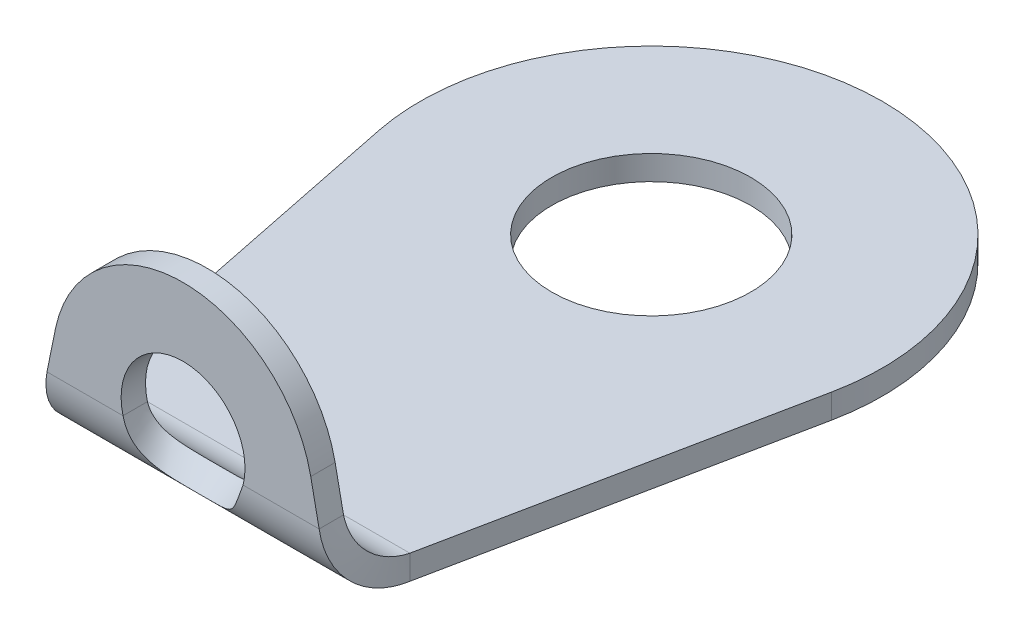
ISO-10303-21;
HEADER;
FILE_DESCRIPTION(('STEP AP214'),'2;1');
FILE_NAME('part.step','',(''),(''),'','','');
FILE_SCHEMA(('AUTOMOTIVE_DESIGN { 1 0 10303 214 1 1 1 1 }'));
ENDSEC;
DATA;
#1=APPLICATION_CONTEXT('core data for automotive mechanical design processes');
#2=APPLICATION_PROTOCOL_DEFINITION('international standard','automotive_design',2000,#1);
#3=PRODUCT_CONTEXT('',#1,'mechanical');
#4=PRODUCT('Part','Part','',(#3));
#5=PRODUCT_RELATED_PRODUCT_CATEGORY('part','',(#4));
#6=PRODUCT_DEFINITION_FORMATION('','',#4);
#7=PRODUCT_DEFINITION_CONTEXT('part definition',#1,'design');
#8=PRODUCT_DEFINITION('design','',#6,#7);
#9=PRODUCT_DEFINITION_SHAPE('','',#8);
#10=(LENGTH_UNIT() NAMED_UNIT(*) SI_UNIT(.MILLI.,.METRE.));
#11=(NAMED_UNIT(*) PLANE_ANGLE_UNIT() SI_UNIT($,.RADIAN.));
#12=(NAMED_UNIT(*) SI_UNIT($,.STERADIAN.) SOLID_ANGLE_UNIT());
#13=UNCERTAINTY_MEASURE_WITH_UNIT(LENGTH_MEASURE(1.E-05),#10,'distance_accuracy_value','');
#14=(GEOMETRIC_REPRESENTATION_CONTEXT(3) GLOBAL_UNCERTAINTY_ASSIGNED_CONTEXT((#13)) GLOBAL_UNIT_ASSIGNED_CONTEXT((#10,
#11,#12)) REPRESENTATION_CONTEXT('',''));
#15=CARTESIAN_POINT('',(0.,0.,0.));
#16=DIRECTION('',(0.,0.,1.));
#17=DIRECTION('',(1.,0.,0.));
#18=AXIS2_PLACEMENT_3D('',#15,#16,#17);
#19=CARTESIAN_POINT('',(3.52763822802631,-6.17797967136799,7.29385006179595));
#20=DIRECTION('',(0.979899507785085,0.199491740787802,0.));
#21=DIRECTION('',(0.199491740787802,-0.979899507785085,0.));
#22=AXIS2_PLACEMENT_3D('',#19,#20,#21);
#23=PLANE('',#22);
#24=DIRECTION('',(0.199491740787802,-0.979899507785085,0.));
#25=VECTOR('',#24,1.);
#26=CARTESIAN_POINT('',(3.52763822802631,-6.17797967136799,7.29385006179595));
#27=LINE('',#26,#25);
#28=CARTESIAN_POINT('',(1.98919600080372,1.37881829559516,7.29385006179592));
#29=VERTEX_POINT('',#28);
#30=CARTESIAN_POINT('',(2.11994129125054,0.736600000000004,7.29385006179592));
#31=VERTEX_POINT('',#30);
#32=EDGE_CURVE('E244',#29,#31,#27,.T.);
#33=ORIENTED_EDGE('',*,*,#32,.T.);
#34=CARTESIAN_POINT('',(2.11994129125054,0.7366,6.91385006179592));
#35=CARTESIAN_POINT('',(2.11994129125054,0.7366,7.29385006179592));
#36=B_SPLINE_CURVE_WITH_KNOTS('',1,(#34,#35),.UNSPECIFIED.,.F.,.F.,(2,2),(0.,1.),.UNSPECIFIED.);
#37=CARTESIAN_POINT('',(2.11994129125054,0.7366,6.91385006179592));
#38=VERTEX_POINT('',#37);
#39=EDGE_CURVE('E12',#31,#38,#36,.F.);
#40=ORIENTED_EDGE('',*,*,#39,.T.);
#41=DIRECTION('',(0.199491740787802,-0.979899507785085,0.));
#42=VECTOR('',#41,1.);
#43=CARTESIAN_POINT('',(3.52763822802631,-6.17797967136799,6.91385006179595));
#44=LINE('',#43,#42);
#45=CARTESIAN_POINT('',(1.98919600080372,1.37881829559516,6.91385006179592));
#46=VERTEX_POINT('',#45);
#47=EDGE_CURVE('E180',#46,#38,#44,.T.);
#48=ORIENTED_EDGE('',*,*,#47,.F.);
#49=DIRECTION('',(0.,0.,-1.));
#50=VECTOR('',#49,1.);
#51=CARTESIAN_POINT('',(1.98919600080372,1.37881829559516,7.29385006179592));
#52=LINE('',#51,#50);
#53=EDGE_CURVE('E154',#29,#46,#52,.T.);
#54=ORIENTED_EDGE('',*,*,#53,.F.);
#55=EDGE_LOOP('',(#33,#40,#48,#54));
#56=FACE_BOUND('',#55,.T.);
#57=ADVANCED_FACE('F64',(#56),#23,.T.);
#58=CARTESIAN_POINT('',(-3.52763822802631,-6.17797967136799,7.29385006179595));
#59=DIRECTION('',(-0.979899507785085,0.199491740787802,0.));
#60=DIRECTION('',(0.199491740787802,0.979899507785085,0.));
#61=AXIS2_PLACEMENT_3D('',#58,#59,#60);
#62=PLANE('',#61);
#63=DIRECTION('',(0.199491740787802,0.979899507785085,0.));
#64=VECTOR('',#63,1.);
#65=CARTESIAN_POINT('',(-3.52763822802631,-6.17797967136799,6.91385006179595));
#66=LINE('',#65,#64);
#67=CARTESIAN_POINT('',(-2.11994129125054,0.736600000000004,6.91385006179592));
#68=VERTEX_POINT('',#67);
#69=CARTESIAN_POINT('',(-1.98919600080372,1.37881829559516,6.91385006179592));
#70=VERTEX_POINT('',#69);
#71=EDGE_CURVE('E185',#68,#70,#66,.T.);
#72=ORIENTED_EDGE('',*,*,#71,.F.);
#73=CARTESIAN_POINT('',(-2.11994129125054,0.7366,7.29385006179592));
#74=CARTESIAN_POINT('',(-2.11994129125054,0.7366,6.91385006179592));
#75=B_SPLINE_CURVE_WITH_KNOTS('',1,(#73,#74),.UNSPECIFIED.,.F.,.F.,(2,2),(0.,1.),.UNSPECIFIED.);
#76=CARTESIAN_POINT('',(-2.11994129125054,0.736600000000006,7.29385006179592));
#77=VERTEX_POINT('',#76);
#78=EDGE_CURVE('E153',#68,#77,#75,.F.);
#79=ORIENTED_EDGE('',*,*,#78,.T.);
#80=DIRECTION('',(0.199491740787802,0.979899507785085,0.));
#81=VECTOR('',#80,1.);
#82=CARTESIAN_POINT('',(-3.52763822802631,-6.17797967136799,7.29385006179595));
#83=LINE('',#82,#81);
#84=CARTESIAN_POINT('',(-1.98919600080372,1.37881829559517,7.29385006179592));
#85=VERTEX_POINT('',#84);
#86=EDGE_CURVE('E172',#77,#85,#83,.T.);
#87=ORIENTED_EDGE('',*,*,#86,.T.);
#88=DIRECTION('',(0.,0.,-1.));
#89=VECTOR('',#88,1.);
#90=CARTESIAN_POINT('',(-1.98919600080372,1.37881829559517,7.29385006179592));
#91=LINE('',#90,#89);
#92=EDGE_CURVE('E263',#85,#70,#91,.T.);
#93=ORIENTED_EDGE('',*,*,#92,.T.);
#94=EDGE_LOOP('',(#72,#79,#87,#93));
#95=FACE_BOUND('',#94,.T.);
#96=ADVANCED_FACE('F184',(#95),#62,.T.);
#97=CARTESIAN_POINT('',(0.,-6.89614993820407,7.29385006179595));
#98=DIRECTION('',(0.,0.,1.));
#99=DIRECTION('',(0.,-1.,0.));
#100=AXIS2_PLACEMENT_3D('',#97,#98,#99);
#101=PLANE('',#100);
#102=ORIENTED_EDGE('',*,*,#86,.F.);
#103=DIRECTION('',(1.,0.,0.));
#104=VECTOR('',#103,1.);
#105=CARTESIAN_POINT('',(0.,0.736600000000003,7.29385006179592));
#106=LINE('',#105,#104);
#107=CARTESIAN_POINT('',(-0.935380889358891,0.736600000000002,7.29385006179592));
#108=VERTEX_POINT('',#107);
#109=EDGE_CURVE('E144',#77,#108,#106,.T.);
#110=ORIENTED_EDGE('',*,*,#109,.T.);
#111=CARTESIAN_POINT('',(0.,0.973850061795926,7.29385006179592));
#112=DIRECTION('',(0.,0.,-1.));
#113=DIRECTION('',(0.,1.,0.));
#114=AXIS2_PLACEMENT_3D('',#111,#112,#113);
#115=CIRCLE('',#114,0.965);
#116=CARTESIAN_POINT('',(0.935380889358893,0.736600000000003,7.29385006179592));
#117=VERTEX_POINT('',#116);
#118=EDGE_CURVE('E258',#108,#117,#115,.T.);
#119=ORIENTED_EDGE('',*,*,#118,.T.);
#120=DIRECTION('',(1.,0.,0.));
#121=VECTOR('',#120,1.);
#122=CARTESIAN_POINT('',(0.,0.736600000000003,7.29385006179592));
#123=LINE('',#122,#121);
#124=EDGE_CURVE('E257',#117,#31,#123,.T.);
#125=ORIENTED_EDGE('',*,*,#124,.T.);
#126=ORIENTED_EDGE('',*,*,#32,.F.);
#127=CARTESIAN_POINT('',(0.,0.973850061795924,7.29385006179592));
#128=DIRECTION('',(0.,0.,-1.));
#129=DIRECTION('',(0.,-1.,0.));
#130=AXIS2_PLACEMENT_3D('',#127,#128,#129);
#131=CIRCLE('',#130,2.03);
#132=EDGE_CURVE('E176',#85,#29,#131,.T.);
#133=ORIENTED_EDGE('',*,*,#132,.F.);
#134=EDGE_LOOP('',(#102,#110,#119,#125,#126,#133));
#135=FACE_BOUND('',#134,.T.);
#136=ADVANCED_FACE('F173',(#135),#101,.T.);
#137=CARTESIAN_POINT('',(0.,0.973850061795924,7.29385006179592));
#138=DIRECTION('',(0.,0.,-1.));
#139=DIRECTION('',(0.,1.,0.));
#140=AXIS2_PLACEMENT_3D('',#137,#138,#139);
#141=CYLINDRICAL_SURFACE('',#140,2.03);
#142=CARTESIAN_POINT('',(0.,0.973850061795923,6.91385006179592));
#143=DIRECTION('',(0.,0.,-1.));
#144=DIRECTION('',(0.,-1.,0.));
#145=AXIS2_PLACEMENT_3D('',#142,#143,#144);
#146=CIRCLE('',#145,2.03);
#147=EDGE_CURVE('E239',#70,#46,#146,.T.);
#148=ORIENTED_EDGE('',*,*,#147,.F.);
#149=ORIENTED_EDGE('',*,*,#92,.F.);
#150=ORIENTED_EDGE('',*,*,#132,.T.);
#151=ORIENTED_EDGE('',*,*,#53,.T.);
#152=EDGE_LOOP('',(#148,#149,#150,#151));
#153=FACE_BOUND('',#152,.T.);
#154=ADVANCED_FACE('F209',(#153),#141,.T.);
#155=CARTESIAN_POINT('',(0.,-6.89614993820407,6.91385006179595));
#156=DIRECTION('',(0.,0.,1.));
#157=DIRECTION('',(0.,-1.,0.));
#158=AXIS2_PLACEMENT_3D('',#155,#156,#157);
#159=PLANE('',#158);
#160=DIRECTION('',(1.,0.,0.));
#161=VECTOR('',#160,1.);
#162=CARTESIAN_POINT('',(0.,0.736600000000001,6.91385006179592));
#163=LINE('',#162,#161);
#164=CARTESIAN_POINT('',(-0.935380889358891,0.736600000000002,6.91385006179592));
#165=VERTEX_POINT('',#164);
#166=EDGE_CURVE('E187',#68,#165,#163,.T.);
#167=ORIENTED_EDGE('',*,*,#166,.F.);
#168=ORIENTED_EDGE('',*,*,#71,.T.);
#169=ORIENTED_EDGE('',*,*,#147,.T.);
#170=ORIENTED_EDGE('',*,*,#47,.T.);
#171=DIRECTION('',(1.,0.,0.));
#172=VECTOR('',#171,1.);
#173=CARTESIAN_POINT('',(0.,0.736600000000001,6.91385006179592));
#174=LINE('',#173,#172);
#175=CARTESIAN_POINT('',(0.935380889358893,0.736600000000002,6.91385006179592));
#176=VERTEX_POINT('',#175);
#177=EDGE_CURVE('E74',#176,#38,#174,.T.);
#178=ORIENTED_EDGE('',*,*,#177,.F.);
#179=CARTESIAN_POINT('',(0.,0.973850061795924,6.91385006179592));
#180=DIRECTION('',(0.,0.,-1.));
#181=DIRECTION('',(0.,1.,0.));
#182=AXIS2_PLACEMENT_3D('',#179,#180,#181);
#183=CIRCLE('',#182,0.965);
#184=EDGE_CURVE('E278',#165,#176,#183,.T.);
#185=ORIENTED_EDGE('',*,*,#184,.F.);
#186=EDGE_LOOP('',(#167,#168,#169,#170,#178,#185));
#187=FACE_BOUND('',#186,.T.);
#188=ADVANCED_FACE('F206',(#187),#159,.F.);
#189=CARTESIAN_POINT('',(0.,0.973850061795926,7.29385006179592));
#190=DIRECTION('',(0.,0.,-1.));
#191=DIRECTION('',(0.,1.,0.));
#192=AXIS2_PLACEMENT_3D('',#189,#190,#191);
#193=CYLINDRICAL_SURFACE('',#192,0.965);
#194=CARTESIAN_POINT('',(-0.935380889358891,0.7366,6.91385006179592));
#195=CARTESIAN_POINT('',(-0.935380889358891,0.7366,7.29385006179592));
#196=B_SPLINE_CURVE_WITH_KNOTS('',1,(#194,#195),.UNSPECIFIED.,.F.,.F.,(2,2),(0.,1.),.UNSPECIFIED.);
#197=EDGE_CURVE('E259',#165,#108,#196,.T.);
#198=ORIENTED_EDGE('',*,*,#197,.F.);
#199=ORIENTED_EDGE('',*,*,#184,.T.);
#200=CARTESIAN_POINT('',(0.935380889358893,0.7366,7.29385006179592));
#201=CARTESIAN_POINT('',(0.935380889358893,0.7366,6.91385006179592));
#202=B_SPLINE_CURVE_WITH_KNOTS('',1,(#200,#201),.UNSPECIFIED.,.F.,.F.,(2,2),(0.,1.),.UNSPECIFIED.);
#203=EDGE_CURVE('E234',#117,#176,#202,.T.);
#204=ORIENTED_EDGE('',*,*,#203,.F.);
#205=ORIENTED_EDGE('',*,*,#118,.F.);
#206=EDGE_LOOP('',(#198,#199,#204,#205));
#207=FACE_BOUND('',#206,.T.);
#208=ADVANCED_FACE('F208',(#207),#193,.F.);
#209=CARTESIAN_POINT('',(0.,-0.38,0.));
#210=DIRECTION('',(0.,1.,0.));
#211=DIRECTION('',(0.,0.,1.));
#212=AXIS2_PLACEMENT_3D('',#209,#210,#211);
#213=CYLINDRICAL_SURFACE('',#212,1.55);
#214=CARTESIAN_POINT('',(0.,-0.38,0.));
#215=DIRECTION('',(0.,1.,0.));
#216=DIRECTION('',(0.,0.,1.));
#217=AXIS2_PLACEMENT_3D('',#214,#215,#216);
#218=CIRCLE('',#217,1.55);
#219=CARTESIAN_POINT('',(0.,-0.38,1.55));
#220=VERTEX_POINT('',#219);
#221=EDGE_CURVE('E356',#220,#220,#218,.T.);
#222=ORIENTED_EDGE('',*,*,#221,.F.);
#223=EDGE_LOOP('',(#222));
#224=FACE_BOUND('',#223,.T.);
#225=CARTESIAN_POINT('',(0.,0.,0.));
#226=DIRECTION('',(0.,1.,0.));
#227=DIRECTION('',(0.,0.,1.));
#228=AXIS2_PLACEMENT_3D('',#225,#226,#227);
#229=CIRCLE('',#228,1.55);
#230=CARTESIAN_POINT('',(0.,0.,1.55));
#231=VERTEX_POINT('',#230);
#232=EDGE_CURVE('E365',#231,#231,#229,.T.);
#233=ORIENTED_EDGE('',*,*,#232,.T.);
#234=EDGE_LOOP('',(#233));
#235=FACE_BOUND('',#234,.T.);
#236=ADVANCED_FACE('F213',(#224,#235),#213,.F.);
#237=CARTESIAN_POINT('',(0.,-0.38,0.));
#238=DIRECTION('',(0.,1.,0.));
#239=DIRECTION('',(0.,0.,1.));
#240=AXIS2_PLACEMENT_3D('',#237,#238,#239);
#241=CYLINDRICAL_SURFACE('',#240,3.6);
#242=CARTESIAN_POINT('',(0.,0.,0.));
#243=DIRECTION('',(0.,1.,0.));
#244=DIRECTION('',(0.,0.,-1.));
#245=AXIS2_PLACEMENT_3D('',#242,#243,#244);
#246=CIRCLE('',#245,3.6);
#247=CARTESIAN_POINT('',(3.52763822802631,0.,0.718170266836086));
#248=VERTEX_POINT('',#247);
#249=CARTESIAN_POINT('',(-3.52763822802631,0.,0.718170266836087));
#250=VERTEX_POINT('',#249);
#251=EDGE_CURVE('E352',#248,#250,#246,.T.);
#252=ORIENTED_EDGE('',*,*,#251,.F.);
#253=DIRECTION('',(0.,1.,0.));
#254=VECTOR('',#253,1.);
#255=CARTESIAN_POINT('',(3.52763822802631,-0.38,0.718170266836086));
#256=LINE('',#255,#254);
#257=CARTESIAN_POINT('',(3.52763822802631,-0.38,0.718170266836086));
#258=VERTEX_POINT('',#257);
#259=EDGE_CURVE('E281',#258,#248,#256,.T.);
#260=ORIENTED_EDGE('',*,*,#259,.F.);
#261=CARTESIAN_POINT('',(0.,-0.38,0.));
#262=DIRECTION('',(0.,1.,0.));
#263=DIRECTION('',(0.,0.,-1.));
#264=AXIS2_PLACEMENT_3D('',#261,#262,#263);
#265=CIRCLE('',#264,3.6);
#266=CARTESIAN_POINT('',(-3.52763822802631,-0.38,0.718170266836087));
#267=VERTEX_POINT('',#266);
#268=EDGE_CURVE('E362',#258,#267,#265,.T.);
#269=ORIENTED_EDGE('',*,*,#268,.T.);
#270=DIRECTION('',(0.,1.,0.));
#271=VECTOR('',#270,1.);
#272=CARTESIAN_POINT('',(-3.52763822802631,-0.38,0.718170266836087));
#273=LINE('',#272,#271);
#274=EDGE_CURVE('E360',#267,#250,#273,.T.);
#275=ORIENTED_EDGE('',*,*,#274,.T.);
#276=EDGE_LOOP('',(#252,#260,#269,#275));
#277=FACE_BOUND('',#276,.T.);
#278=ADVANCED_FACE('F423',(#277),#241,.T.);
#279=CARTESIAN_POINT('',(0.,-0.38,0.));
#280=DIRECTION('',(0.,-1.,0.));
#281=DIRECTION('',(0.,0.,-1.));
#282=AXIS2_PLACEMENT_3D('',#279,#280,#281);
#283=PLANE('',#282);
#284=DIRECTION('',(1.,0.,0.));
#285=VECTOR('',#284,1.);
#286=CARTESIAN_POINT('',(0.,-0.38,6.17725006179592));
#287=LINE('',#286,#285);
#288=CARTESIAN_POINT('',(-2.41625759894765,-0.38,6.17725006179592));
#289=VERTEX_POINT('',#288);
#290=CARTESIAN_POINT('',(2.41625759894765,-0.38,6.17725006179592));
#291=VERTEX_POINT('',#290);
#292=EDGE_CURVE('E372',#289,#291,#287,.T.);
#293=ORIENTED_EDGE('',*,*,#292,.F.);
#294=DIRECTION('',(0.199491740787802,0.,0.979899507785085));
#295=VECTOR('',#294,1.);
#296=CARTESIAN_POINT('',(-3.52763822802631,-0.38,0.718170266836087));
#297=LINE('',#296,#295);
#298=EDGE_CURVE('E359',#267,#289,#297,.T.);
#299=ORIENTED_EDGE('',*,*,#298,.F.);
#300=ORIENTED_EDGE('',*,*,#268,.F.);
#301=DIRECTION('',(0.199491740787802,0.,-0.979899507785085));
#302=VECTOR('',#301,1.);
#303=CARTESIAN_POINT('',(3.52763822802631,-0.38,0.718170266836086));
#304=LINE('',#303,#302);
#305=EDGE_CURVE('E287',#291,#258,#304,.T.);
#306=ORIENTED_EDGE('',*,*,#305,.F.);
#307=EDGE_LOOP('',(#293,#299,#300,#306));
#308=FACE_BOUND('',#307,.T.);
#309=ORIENTED_EDGE('',*,*,#221,.T.);
#310=EDGE_LOOP('',(#309));
#311=FACE_BOUND('',#310,.T.);
#312=ADVANCED_FACE('F398',(#308,#311),#283,.T.);
#313=CARTESIAN_POINT('',(-3.52763822802631,-0.38,0.718170266836087));
#314=DIRECTION('',(-0.979899507785085,0.,0.199491740787802));
#315=DIRECTION('',(0.199491740787802,0.,0.979899507785085));
#316=AXIS2_PLACEMENT_3D('',#313,#314,#315);
#317=PLANE('',#316);
#318=CARTESIAN_POINT('',(-2.41625759894765,0.,6.17725006179592));
#319=CARTESIAN_POINT('',(-2.41625759894765,-0.38,6.17725006179592));
#320=B_SPLINE_CURVE_WITH_KNOTS('',1,(#318,#319),.UNSPECIFIED.,.F.,.F.,(2,2),(0.,1.),.UNSPECIFIED.);
#321=CARTESIAN_POINT('',(-2.41625759894765,0.,6.17725006179592));
#322=VERTEX_POINT('',#321);
#323=EDGE_CURVE('E165',#322,#289,#320,.T.);
#324=ORIENTED_EDGE('',*,*,#323,.F.);
#325=DIRECTION('',(0.199491740787802,0.,0.979899507785085));
#326=VECTOR('',#325,1.);
#327=CARTESIAN_POINT('',(-3.52763822802631,0.,0.718170266836087));
#328=LINE('',#327,#326);
#329=EDGE_CURVE('E369',#250,#322,#328,.T.);
#330=ORIENTED_EDGE('',*,*,#329,.F.);
#331=ORIENTED_EDGE('',*,*,#274,.F.);
#332=ORIENTED_EDGE('',*,*,#298,.T.);
#333=EDGE_LOOP('',(#324,#330,#331,#332));
#334=FACE_BOUND('',#333,.T.);
#335=ADVANCED_FACE('F387',(#334),#317,.T.);
#336=CARTESIAN_POINT('',(0.,0.,0.));
#337=DIRECTION('',(0.,-1.,0.));
#338=DIRECTION('',(0.,0.,-1.));
#339=AXIS2_PLACEMENT_3D('',#336,#337,#338);
#340=PLANE('',#339);
#341=ORIENTED_EDGE('',*,*,#232,.F.);
#342=EDGE_LOOP('',(#341));
#343=FACE_BOUND('',#342,.T.);
#344=ORIENTED_EDGE('',*,*,#329,.T.);
#345=DIRECTION('',(1.,0.,0.));
#346=VECTOR('',#345,1.);
#347=CARTESIAN_POINT('',(0.,0.,6.17725006179592));
#348=LINE('',#347,#346);
#349=CARTESIAN_POINT('',(2.41625759894765,0.,6.17725006179592));
#350=VERTEX_POINT('',#349);
#351=EDGE_CURVE('E385',#322,#350,#348,.T.);
#352=ORIENTED_EDGE('',*,*,#351,.T.);
#353=DIRECTION('',(0.199491740787802,0.,-0.979899507785085));
#354=VECTOR('',#353,1.);
#355=CARTESIAN_POINT('',(3.52763822802631,0.,0.718170266836086));
#356=LINE('',#355,#354);
#357=EDGE_CURVE('E355',#350,#248,#356,.T.);
#358=ORIENTED_EDGE('',*,*,#357,.T.);
#359=ORIENTED_EDGE('',*,*,#251,.T.);
#360=EDGE_LOOP('',(#344,#352,#358,#359));
#361=FACE_BOUND('',#360,.T.);
#362=ADVANCED_FACE('F397',(#343,#361),#340,.F.);
#363=CARTESIAN_POINT('',(3.52763822802631,-0.38,0.718170266836086));
#364=DIRECTION('',(0.979899507785085,0.,0.199491740787802));
#365=DIRECTION('',(0.199491740787802,0.,-0.979899507785085));
#366=AXIS2_PLACEMENT_3D('',#363,#364,#365);
#367=PLANE('',#366);
#368=CARTESIAN_POINT('',(2.41625759894765,-0.38,6.17725006179592));
#369=CARTESIAN_POINT('',(2.41625759894765,0.,6.17725006179592));
#370=B_SPLINE_CURVE_WITH_KNOTS('',1,(#368,#369),.UNSPECIFIED.,.F.,.F.,(2,2),(0.,1.),.UNSPECIFIED.);
#371=EDGE_CURVE('E374',#291,#350,#370,.T.);
#372=ORIENTED_EDGE('',*,*,#371,.F.);
#373=ORIENTED_EDGE('',*,*,#305,.T.);
#374=ORIENTED_EDGE('',*,*,#259,.T.);
#375=ORIENTED_EDGE('',*,*,#357,.F.);
#376=EDGE_LOOP('',(#372,#373,#374,#375));
#377=FACE_BOUND('',#376,.T.);
#378=ADVANCED_FACE('F401',(#377),#367,.T.);
#379=CARTESIAN_POINT('',(-2.11994129125054,0.7366,7.29385006179592));
#380=CARTESIAN_POINT('',(-2.14463864543435,0.590411780346592,7.29385006179592));
#381=CARTESIAN_POINT('',(-2.16932734253339,0.444332312324427,7.26478795256376));
#382=CARTESIAN_POINT('',(-2.21871339381624,0.174259046517853,7.15291994303228));
#383=CARTESIAN_POINT('',(-2.24340641945767,0.0503971324760098,7.07015805801773));
#384=CARTESIAN_POINT('',(-2.29279247074052,-0.156307996221808,6.86345292931991));
#385=CARTESIAN_POINT('',(-2.31748549638195,-0.239069881236364,6.73959101527807));
#386=CARTESIAN_POINT('',(-2.3668715476648,-0.350937890767841,6.46951774947149));
#387=CARTESIAN_POINT('',(-2.39156024476384,-0.38,6.32343828144933));
#388=CARTESIAN_POINT('',(-2.41625759894765,-0.38,6.17725006179592));
#389=CARTESIAN_POINT('',(-2.11994129125054,0.7366,6.91385006179592));
#390=CARTESIAN_POINT('',(-2.14463849495673,0.640162971069842,6.91385006179592));
#391=CARTESIAN_POINT('',(-2.16932734253339,0.543796508380954,6.8946783354298));
#392=CARTESIAN_POINT('',(-2.21871339381624,0.365634259058795,6.82088111545767));
#393=CARTESIAN_POINT('',(-2.24340641945767,0.283924886066478,6.76628465790642));
#394=CARTESIAN_POINT('',(-2.29279247074052,0.1475654038895,6.62992517572944));
#395=CARTESIAN_POINT('',(-2.31748549638195,0.0929689463382539,6.54821580273713));
#396=CARTESIAN_POINT('',(-2.3668715476648,0.019171726366119,6.37005355341497));
#397=CARTESIAN_POINT('',(-2.39156039524146,0.,6.27368709072608));
#398=CARTESIAN_POINT('',(-2.41625759894765,0.,6.17725006179592));
#399=B_SPLINE_SURFACE_WITH_KNOTS('',1,3,((#379,#380,#381,#382,#383,#384,#385,#386,#387,#388),
(#389,#390,#391,#392,#393,#394,#395,#396,#397,#398)),.UNSPECIFIED.,.F.,.F.,.F.,(2,2),(4,2,2,2,
4),(0.,1.),(0.,0.25,0.5,0.75,1.),.UNSPECIFIED.);
#400=CARTESIAN_POINT('',(-2.11994129125054,0.7366,6.91385006179592));
#401=CARTESIAN_POINT('',(-2.14463849495673,0.640162971069842,6.91385006179592));
#402=CARTESIAN_POINT('',(-2.16932734253339,0.543796508380954,6.8946783354298));
#403=CARTESIAN_POINT('',(-2.21871339381624,0.365634259058795,6.82088111545767));
#404=CARTESIAN_POINT('',(-2.24340641945767,0.283924886066478,6.76628465790642));
#405=CARTESIAN_POINT('',(-2.29279247074052,0.1475654038895,6.62992517572944));
#406=CARTESIAN_POINT('',(-2.31748549638195,0.0929689463382539,6.54821580273713));
#407=CARTESIAN_POINT('',(-2.3668715476648,0.019171726366119,6.37005355341497));
#408=CARTESIAN_POINT('',(-2.39156039524146,0.,6.27368709072608));
#409=CARTESIAN_POINT('',(-2.41625759894765,0.,6.17725006179592));
#410=B_SPLINE_CURVE_WITH_KNOTS('',3,(#400,#401,#402,#403,#404,#405,#406,#407,#408,#409),
.UNSPECIFIED.,.F.,.F.,(4,2,2,2,4),(0.,0.25,0.5,0.75,1.),.UNSPECIFIED.);
#411=EDGE_CURVE('E439',#68,#322,#410,.T.);
#412=CARTESIAN_POINT('',(-2.41625759894765,-0.38,6.17725006179592));
#413=CARTESIAN_POINT('',(-2.39156024476384,-0.38,6.32343828144933));
#414=CARTESIAN_POINT('',(-2.3668715476648,-0.350937890767841,6.46951774947149));
#415=CARTESIAN_POINT('',(-2.31748549638195,-0.239069881236364,6.73959101527807));
#416=CARTESIAN_POINT('',(-2.29279247074052,-0.156307996221808,6.86345292931991));
#417=CARTESIAN_POINT('',(-2.24340641945767,0.0503971324760098,7.07015805801773));
#418=CARTESIAN_POINT('',(-2.21871339381624,0.174259046517853,7.15291994303228));
#419=CARTESIAN_POINT('',(-2.16932734253339,0.444332312324427,7.26478795256376));
#420=CARTESIAN_POINT('',(-2.14463864543435,0.590411780346592,7.29385006179592));
#421=CARTESIAN_POINT('',(-2.11994129125054,0.7366,7.29385006179592));
#422=B_SPLINE_CURVE_WITH_KNOTS('',3,(#412,#413,#414,#415,#416,#417,#418,#419,#420,#421),
.UNSPECIFIED.,.F.,.F.,(4,2,2,2,4),(0.,0.25,0.5,0.75,1.),.UNSPECIFIED.);
#423=EDGE_CURVE('E147',#77,#289,#422,.F.);
#424=ORIENTED_EDGE('',*,*,#78,.F.);
#425=ORIENTED_EDGE('',*,*,#411,.T.);
#426=ORIENTED_EDGE('',*,*,#323,.T.);
#427=ORIENTED_EDGE('',*,*,#423,.F.);
#428=EDGE_LOOP('',(#424,#425,#426,#427));
#429=FACE_BOUND('',#428,.T.);
#430=ADVANCED_FACE('F159',(#429),#399,.T.);
#431=CARTESIAN_POINT('',(2.41625759894765,-0.38,6.17725006179592));
#432=CARTESIAN_POINT('',(2.39156024476384,-0.38,6.32343828144933));
#433=CARTESIAN_POINT('',(2.3668715476648,-0.350937890767841,6.46951774947149));
#434=CARTESIAN_POINT('',(2.31748549638195,-0.239069881236364,6.73959101527807));
#435=CARTESIAN_POINT('',(2.29279247074052,-0.156307996221808,6.86345292931991));
#436=CARTESIAN_POINT('',(2.24340641945767,0.0503971324760098,7.07015805801773));
#437=CARTESIAN_POINT('',(2.21871339381624,0.174259046517853,7.15291994303228));
#438=CARTESIAN_POINT('',(2.16932734253339,0.444332312324427,7.26478795256376));
#439=CARTESIAN_POINT('',(2.14463864543435,0.590411780346592,7.29385006179592));
#440=CARTESIAN_POINT('',(2.11994129125054,0.7366,7.29385006179592));
#441=CARTESIAN_POINT('',(2.41625759894765,0.,6.17725006179592));
#442=CARTESIAN_POINT('',(2.39156039524147,0.,6.27368709072608));
#443=CARTESIAN_POINT('',(2.3668715476648,0.019171726366119,6.37005355341497));
#444=CARTESIAN_POINT('',(2.31748549638195,0.0929689463382539,6.54821580273712));
#445=CARTESIAN_POINT('',(2.29279247074052,0.1475654038895,6.62992517572944));
#446=CARTESIAN_POINT('',(2.24340641945767,0.283924886066478,6.76628465790642));
#447=CARTESIAN_POINT('',(2.21871339381624,0.365634259058795,6.82088111545767));
#448=CARTESIAN_POINT('',(2.16932734253339,0.543796508380954,6.8946783354298));
#449=CARTESIAN_POINT('',(2.14463849495673,0.640162971069842,6.91385006179592));
#450=CARTESIAN_POINT('',(2.11994129125054,0.7366,6.91385006179592));
#451=B_SPLINE_SURFACE_WITH_KNOTS('',1,3,((#431,#432,#433,#434,#435,#436,#437,#438,#439,#440),
(#441,#442,#443,#444,#445,#446,#447,#448,#449,#450)),.UNSPECIFIED.,.F.,.F.,.F.,(2,2),(4,2,2,2,
4),(0.,1.),(0.,0.25,0.5,0.75,1.),.UNSPECIFIED.);
#452=CARTESIAN_POINT('',(2.41625759894765,0.,6.17725006179592));
#453=CARTESIAN_POINT('',(2.39156039524147,0.,6.27368709072608));
#454=CARTESIAN_POINT('',(2.3668715476648,0.019171726366119,6.37005355341497));
#455=CARTESIAN_POINT('',(2.31748549638195,0.0929689463382539,6.54821580273712));
#456=CARTESIAN_POINT('',(2.29279247074052,0.1475654038895,6.62992517572944));
#457=CARTESIAN_POINT('',(2.24340641945767,0.283924886066478,6.76628465790642));
#458=CARTESIAN_POINT('',(2.21871339381624,0.365634259058795,6.82088111545767));
#459=CARTESIAN_POINT('',(2.16932734253339,0.543796508380954,6.8946783354298));
#460=CARTESIAN_POINT('',(2.14463849495673,0.640162971069842,6.91385006179592));
#461=CARTESIAN_POINT('',(2.11994129125054,0.7366,6.91385006179592));
#462=B_SPLINE_CURVE_WITH_KNOTS('',3,(#452,#453,#454,#455,#456,#457,#458,#459,#460,#461),
.UNSPECIFIED.,.F.,.F.,(4,2,2,2,4),(0.,0.25,0.5,0.75,1.),.UNSPECIFIED.);
#463=EDGE_CURVE('E253',#350,#38,#462,.T.);
#464=CARTESIAN_POINT('',(2.11994129125054,0.7366,7.29385006179592));
#465=CARTESIAN_POINT('',(2.14463864543435,0.590411780346592,7.29385006179592));
#466=CARTESIAN_POINT('',(2.16932734253339,0.444332312324427,7.26478795256376));
#467=CARTESIAN_POINT('',(2.21871339381624,0.174259046517853,7.15291994303228));
#468=CARTESIAN_POINT('',(2.24340641945767,0.0503971324760098,7.07015805801773));
#469=CARTESIAN_POINT('',(2.29279247074052,-0.156307996221808,6.86345292931991));
#470=CARTESIAN_POINT('',(2.31748549638195,-0.239069881236364,6.73959101527807));
#471=CARTESIAN_POINT('',(2.3668715476648,-0.350937890767841,6.46951774947149));
#472=CARTESIAN_POINT('',(2.39156024476384,-0.38,6.32343828144933));
#473=CARTESIAN_POINT('',(2.41625759894765,-0.38,6.17725006179592));
#474=B_SPLINE_CURVE_WITH_KNOTS('',3,(#464,#465,#466,#467,#468,#469,#470,#471,#472,#473),
.UNSPECIFIED.,.F.,.F.,(4,2,2,2,4),(0.,0.25,0.5,0.75,1.),.UNSPECIFIED.);
#475=EDGE_CURVE('E81',#291,#31,#474,.F.);
#476=ORIENTED_EDGE('',*,*,#371,.T.);
#477=ORIENTED_EDGE('',*,*,#463,.T.);
#478=ORIENTED_EDGE('',*,*,#39,.F.);
#479=ORIENTED_EDGE('',*,*,#475,.F.);
#480=EDGE_LOOP('',(#476,#477,#478,#479));
#481=FACE_BOUND('',#480,.T.);
#482=ADVANCED_FACE('F250',(#481),#451,.T.);
#483=CARTESIAN_POINT('',(0.935380889358893,0.7366,7.29385006179592));
#484=CARTESIAN_POINT('',(0.88051809324851,0.590403201086514,7.29385006179592));
#485=CARTESIAN_POINT('',(0.820089247889691,0.464158103045472,7.26562337533322));
#486=CARTESIAN_POINT('',(0.687343792323709,0.257956761427396,7.19198239448522));
#487=CARTESIAN_POINT('',(0.61515312650846,0.17777506475981,7.14671031860404));
#488=CARTESIAN_POINT('',(0.459135918813439,0.0561591950865606,7.06558491351874));
#489=CARTESIAN_POINT('',(0.375309376933668,0.0143843798756854,7.02962789258985));
#490=CARTESIAN_POINT('',(0.240842657065623,-0.0264381863033294,6.99266727913809));
#491=CARTESIAN_POINT('',(0.194565932601544,-0.0363869001523835,6.98308662689109));
#492=CARTESIAN_POINT('',(0.122969119143327,-0.0463312834101933,6.97338799257209));
#493=CARTESIAN_POINT('',(0.0987398935302385,-0.048813195224883,6.97092960990225));
#494=CARTESIAN_POINT('',(0.0618506234200812,-0.0513202630281516,6.9684381602836));
#495=CARTESIAN_POINT('',(0.0494632947682737,-0.0519530978073076,6.9678067919894));
#496=CARTESIAN_POINT('',(0.0307459438679328,-0.052600233571418,6.96716059107107));
#497=CARTESIAN_POINT('',(0.0244841005807146,-0.0527655785146161,6.96699531815057));
#498=CARTESIAN_POINT('',(0.0150572461692287,-0.0529381873784854,6.96682274197849));
#499=CARTESIAN_POINT('',(0.0119092797852901,-0.0529831546776401,6.96677777122084));
#500=CARTESIAN_POINT('',(0.0056019838571943,-0.0530479641751271,6.96671295185126));
#501=CARTESIAN_POINT('',(0.0031076762986719,-0.0530662762001361,6.96669463387656));
#502=CARTESIAN_POINT('',(-0.123283416328106,-0.0533570940994153,6.96640372781043));
#503=CARTESIAN_POINT('',(-0.234676263727173,-0.0409541185321764,6.9794510023148));
#504=CARTESIAN_POINT('',(-0.435125534289687,0.0128642539568959,7.02832193074423));
#505=CARTESIAN_POINT('',(-0.524181957453134,0.0544217930706368,7.064251410029));
#506=CARTESIAN_POINT('',(-0.679958379544411,0.175878646003295,7.14561469402324));
#507=CARTESIAN_POINT('',(-0.74667837847224,0.256124855145676,7.19115566833044));
#508=CARTESIAN_POINT('',(-0.857781952092279,0.462903568808617,7.26534528158967));
#509=CARTESIAN_POINT('',(-0.902081504567192,0.589639504081672,7.29385006179592));
#510=CARTESIAN_POINT('',(-0.935380889358891,0.7366,7.29385006179592));
#511=CARTESIAN_POINT('',(0.935380889358893,0.7366,6.91385006179592));
#512=CARTESIAN_POINT('',(0.880535485020729,0.640187296898029,6.91385006179592));
#513=CARTESIAN_POINT('',(0.820089247889691,0.556875209299028,6.89522944810397));
#514=CARTESIAN_POINT('',(0.687343792323709,0.420848065974763,6.84664987933034));
#515=CARTESIAN_POINT('',(0.61515312650846,0.367953710103955,6.81678474311856));
#516=CARTESIAN_POINT('',(0.459135918813439,0.287726010299803,6.76326784056991));
#517=CARTESIAN_POINT('',(0.375309376933668,0.260167951116273,6.7395476707542));
#518=CARTESIAN_POINT('',(0.240842657065623,0.233238072692968,6.71516544984379));
#519=CARTESIAN_POINT('',(0.194565932601544,0.226675093451329,6.70884527391226));
#520=CARTESIAN_POINT('',(0.122969119143327,0.220114971019212,6.70244726742885));
#521=CARTESIAN_POINT('',(0.0987398935302385,0.218477700517062,6.70082551866062));
#522=CARTESIAN_POINT('',(0.0618506234200812,0.216823835082808,6.69918195624875));
#523=CARTESIAN_POINT('',(0.0494632947682737,0.216406365892117,6.69876545447057));
#524=CARTESIAN_POINT('',(0.0307459438679328,0.215979462610867,6.69833916788948));
#525=CARTESIAN_POINT('',(0.0244841005807146,0.215870387664458,6.69823014045509));
#526=CARTESIAN_POINT('',(0.0150572461692287,0.215756520846326,6.69811629520312));
#527=CARTESIAN_POINT('',(0.0119092797852901,0.215726856765583,6.69808662884087));
#528=CARTESIAN_POINT('',(0.0056019838571943,0.21568410316013,6.69804386872299));
#529=CARTESIAN_POINT('',(0.0031076762986719,0.215672023061956,6.69803178469991));
#530=CARTESIAN_POINT('',(-0.123283416328106,0.21548017596845,6.6978398794444));
#531=CARTESIAN_POINT('',(-0.234676263727173,0.223662185464086,6.70644692081993));
#532=CARTESIAN_POINT('',(-0.435125534289687,0.259165152664024,6.73868615230937));
#533=CARTESIAN_POINT('',(-0.524181957453134,0.286579878896499,6.76238815342093));
#534=CARTESIAN_POINT('',(-0.679958379544411,0.366702678350373,6.81606198020775));
#535=CARTESIAN_POINT('',(-0.74667837847224,0.419639591886356,6.84610450364916));
#536=CARTESIAN_POINT('',(-0.857781952092279,0.556047616679587,6.89504599489647));
#537=CARTESIAN_POINT('',(-0.902086512682644,0.639667507888259,6.91385006179592));
#538=CARTESIAN_POINT('',(-0.935380889358891,0.7366,6.91385006179592));
#539=B_SPLINE_SURFACE_WITH_KNOTS('',1,3,((#483,#484,#485,#486,#487,#488,#489,#490,#491,#492,
#493,#494,#495,#496,#497,#498,#499,#500,#501,#502,#503,#504,#505,#506,#507,#508,#509,#510),
(#511,#512,#513,#514,#515,#516,#517,#518,#519,#520,#521,#522,#523,#524,#525,#526,#527,#528,#529,
#530,#531,#532,#533,#534,#535,#536,#537,#538)),.UNSPECIFIED.,.F.,.F.,.F.,(2,2),(4,2,2,2,2,2,2,2,
2,2,2,2,2,4),(0.,1.),(0.,0.125,0.25,0.375,0.4375,0.46875,0.484375,0.4921875,0.49609375,0.5,
0.625,0.75,0.875,1.),.UNSPECIFIED.);
#540=CARTESIAN_POINT('',(0.935380889358893,0.7366,6.91385006179592));
#541=CARTESIAN_POINT('',(0.880535485020729,0.640187296898029,6.91385006179592));
#542=CARTESIAN_POINT('',(0.820089247889691,0.556875209299028,6.89522944810397));
#543=CARTESIAN_POINT('',(0.687343792323709,0.420848065974763,6.84664987933034));
#544=CARTESIAN_POINT('',(0.61515312650846,0.367953710103955,6.81678474311856));
#545=CARTESIAN_POINT('',(0.459135918813439,0.287726010299803,6.76326784056991));
#546=CARTESIAN_POINT('',(0.375309376933668,0.260167951116273,6.7395476707542));
#547=CARTESIAN_POINT('',(0.240842657065623,0.233238072692968,6.71516544984379));
#548=CARTESIAN_POINT('',(0.194565932601544,0.226675093451329,6.70884527391226));
#549=CARTESIAN_POINT('',(0.122969119143327,0.220114971019212,6.70244726742885));
#550=CARTESIAN_POINT('',(0.0987398935302385,0.218477700517062,6.70082551866062));
#551=CARTESIAN_POINT('',(0.0618506234200812,0.216823835082808,6.69918195624875));
#552=CARTESIAN_POINT('',(0.0494632947682737,0.216406365892117,6.69876545447057));
#553=CARTESIAN_POINT('',(0.0307459438679328,0.215979462610867,6.69833916788948));
#554=CARTESIAN_POINT('',(0.0244841005807146,0.215870387664458,6.69823014045509));
#555=CARTESIAN_POINT('',(0.0150572461692287,0.215756520846326,6.69811629520312));
#556=CARTESIAN_POINT('',(0.0119092797852901,0.215726856765583,6.69808662884087));
#557=CARTESIAN_POINT('',(0.0056019838571943,0.21568410316013,6.69804386872299));
#558=CARTESIAN_POINT('',(0.0031076762986719,0.215672023061956,6.69803178469991));
#559=CARTESIAN_POINT('',(-0.123283416328106,0.21548017596845,6.6978398794444));
#560=CARTESIAN_POINT('',(-0.234676263727173,0.223662185464086,6.70644692081993));
#561=CARTESIAN_POINT('',(-0.435125534289687,0.259165152664024,6.73868615230937));
#562=CARTESIAN_POINT('',(-0.524181957453134,0.286579878896499,6.76238815342093));
#563=CARTESIAN_POINT('',(-0.679958379544411,0.366702678350373,6.81606198020775));
#564=CARTESIAN_POINT('',(-0.74667837847224,0.419639591886356,6.84610450364916));
#565=CARTESIAN_POINT('',(-0.857781952092279,0.556047616679587,6.89504599489647));
#566=CARTESIAN_POINT('',(-0.902086512682644,0.639667507888259,6.91385006179592));
#567=CARTESIAN_POINT('',(-0.935380889358891,0.7366,6.91385006179592));
#568=B_SPLINE_CURVE_WITH_KNOTS('',3,(#540,#541,#542,#543,#544,#545,#546,#547,#548,#549,#550,
#551,#552,#553,#554,#555,#556,#557,#558,#559,#560,#561,#562,#563,#564,#565,#566,#567),
.UNSPECIFIED.,.F.,.F.,(4,2,2,2,2,2,2,2,2,2,2,2,2,4),(0.,0.125,0.25,0.375,0.4375,0.46875,
0.484375,0.4921875,0.49609375,0.5,0.625,0.75,0.875,1.),.UNSPECIFIED.);
#569=EDGE_CURVE('E168',#176,#165,#568,.T.);
#570=CARTESIAN_POINT('',(-0.935380889358891,0.7366,7.29385006179592));
#571=CARTESIAN_POINT('',(-0.902081504567192,0.589639504081672,7.29385006179592));
#572=CARTESIAN_POINT('',(-0.857781952092279,0.462903568808617,7.26534528158967));
#573=CARTESIAN_POINT('',(-0.74667837847224,0.256124855145676,7.19115566833044));
#574=CARTESIAN_POINT('',(-0.679958379544411,0.175878646003295,7.14561469402324));
#575=CARTESIAN_POINT('',(-0.524181957453134,0.0544217930706368,7.064251410029));
#576=CARTESIAN_POINT('',(-0.435125534289687,0.0128642539568959,7.02832193074423));
#577=CARTESIAN_POINT('',(-0.234676263727173,-0.0409541185321764,6.9794510023148));
#578=CARTESIAN_POINT('',(-0.123283416328106,-0.0533570940994153,6.96640372781043));
#579=CARTESIAN_POINT('',(0.0031076762986719,-0.0530662762001361,6.96669463387656));
#580=CARTESIAN_POINT('',(0.0056019838571943,-0.0530479641751271,6.96671295185126));
#581=CARTESIAN_POINT('',(0.0119092797852901,-0.0529831546776401,6.96677777122084));
#582=CARTESIAN_POINT('',(0.0150572461692287,-0.0529381873784854,6.96682274197849));
#583=CARTESIAN_POINT('',(0.0244841005807146,-0.0527655785146161,6.96699531815057));
#584=CARTESIAN_POINT('',(0.0307459438679328,-0.052600233571418,6.96716059107107));
#585=CARTESIAN_POINT('',(0.0494632947682737,-0.0519530978073076,6.9678067919894));
#586=CARTESIAN_POINT('',(0.0618506234200812,-0.0513202630281516,6.9684381602836));
#587=CARTESIAN_POINT('',(0.0987398935302385,-0.048813195224883,6.97092960990225));
#588=CARTESIAN_POINT('',(0.122969119143327,-0.0463312834101933,6.97338799257209));
#589=CARTESIAN_POINT('',(0.194565932601544,-0.0363869001523835,6.98308662689109));
#590=CARTESIAN_POINT('',(0.240842657065623,-0.0264381863033294,6.99266727913809));
#591=CARTESIAN_POINT('',(0.375309376933668,0.0143843798756854,7.02962789258985));
#592=CARTESIAN_POINT('',(0.459135918813439,0.0561591950865606,7.06558491351874));
#593=CARTESIAN_POINT('',(0.61515312650846,0.17777506475981,7.14671031860404));
#594=CARTESIAN_POINT('',(0.687343792323709,0.257956761427396,7.19198239448522));
#595=CARTESIAN_POINT('',(0.820089247889691,0.464158103045472,7.26562337533322));
#596=CARTESIAN_POINT('',(0.88051809324851,0.590403201086514,7.29385006179592));
#597=CARTESIAN_POINT('',(0.935380889358893,0.7366,7.29385006179592));
#598=B_SPLINE_CURVE_WITH_KNOTS('',3,(#570,#571,#572,#573,#574,#575,#576,#577,#578,#579,#580,
#581,#582,#583,#584,#585,#586,#587,#588,#589,#590,#591,#592,#593,#594,#595,#596,#597),
.UNSPECIFIED.,.F.,.F.,(4,2,2,2,2,2,2,2,2,2,2,2,2,4),(0.,0.125,0.25,0.375,0.5,0.50390625,
0.5078125,0.515625,0.53125,0.5625,0.625,0.75,0.875,1.),.UNSPECIFIED.);
#599=EDGE_CURVE('E88',#117,#108,#598,.F.);
#600=ORIENTED_EDGE('',*,*,#569,.T.);
#601=ORIENTED_EDGE('',*,*,#197,.T.);
#602=ORIENTED_EDGE('',*,*,#599,.F.);
#603=ORIENTED_EDGE('',*,*,#203,.T.);
#604=EDGE_LOOP('',(#600,#601,#602,#603));
#605=FACE_BOUND('',#604,.T.);
#606=ADVANCED_FACE('F297',(#605),#539,.T.);
#607=CARTESIAN_POINT('',(5.0612333504901,0.7366,6.17725006179592));
#608=DIRECTION('',(-1.,0.,0.));
#609=DIRECTION('',(0.,0.,1.));
#610=AXIS2_PLACEMENT_3D('',#607,#608,#609);
#611=CYLINDRICAL_SURFACE('',#610,1.1166);
#612=ORIENTED_EDGE('',*,*,#124,.F.);
#613=ORIENTED_EDGE('',*,*,#599,.T.);
#614=ORIENTED_EDGE('',*,*,#109,.F.);
#615=ORIENTED_EDGE('',*,*,#423,.T.);
#616=ORIENTED_EDGE('',*,*,#292,.T.);
#617=ORIENTED_EDGE('',*,*,#475,.T.);
#618=EDGE_LOOP('',(#612,#613,#614,#615,#616,#617));
#619=FACE_BOUND('',#618,.T.);
#620=ADVANCED_FACE('F146',(#619),#611,.T.);
#621=CARTESIAN_POINT('',(5.0612333504901,0.7366,6.17725006179592));
#622=DIRECTION('',(-1.,0.,0.));
#623=DIRECTION('',(0.,0.,1.));
#624=AXIS2_PLACEMENT_3D('',#621,#622,#623);
#625=CYLINDRICAL_SURFACE('',#624,0.7366);
#626=ORIENTED_EDGE('',*,*,#177,.T.);
#627=ORIENTED_EDGE('',*,*,#463,.F.);
#628=ORIENTED_EDGE('',*,*,#351,.F.);
#629=ORIENTED_EDGE('',*,*,#411,.F.);
#630=ORIENTED_EDGE('',*,*,#166,.T.);
#631=ORIENTED_EDGE('',*,*,#569,.F.);
#632=EDGE_LOOP('',(#626,#627,#628,#629,#630,#631));
#633=FACE_BOUND('',#632,.T.);
#634=ADVANCED_FACE('F438',(#633),#625,.F.);
#635=CLOSED_SHELL('',(#57,#96,#136,#154,#188,#208,#236,#278,#312,#335,#362,#378,#430,#482,#606,
#620,#634));
#636=MANIFOLD_SOLID_BREP('B2',#635);
#637=ADVANCED_BREP_SHAPE_REPRESENTATION('',(#18,#636),#14);
#638=SHAPE_DEFINITION_REPRESENTATION(#9,#637);
ENDSEC;
END-ISO-10303-21;
